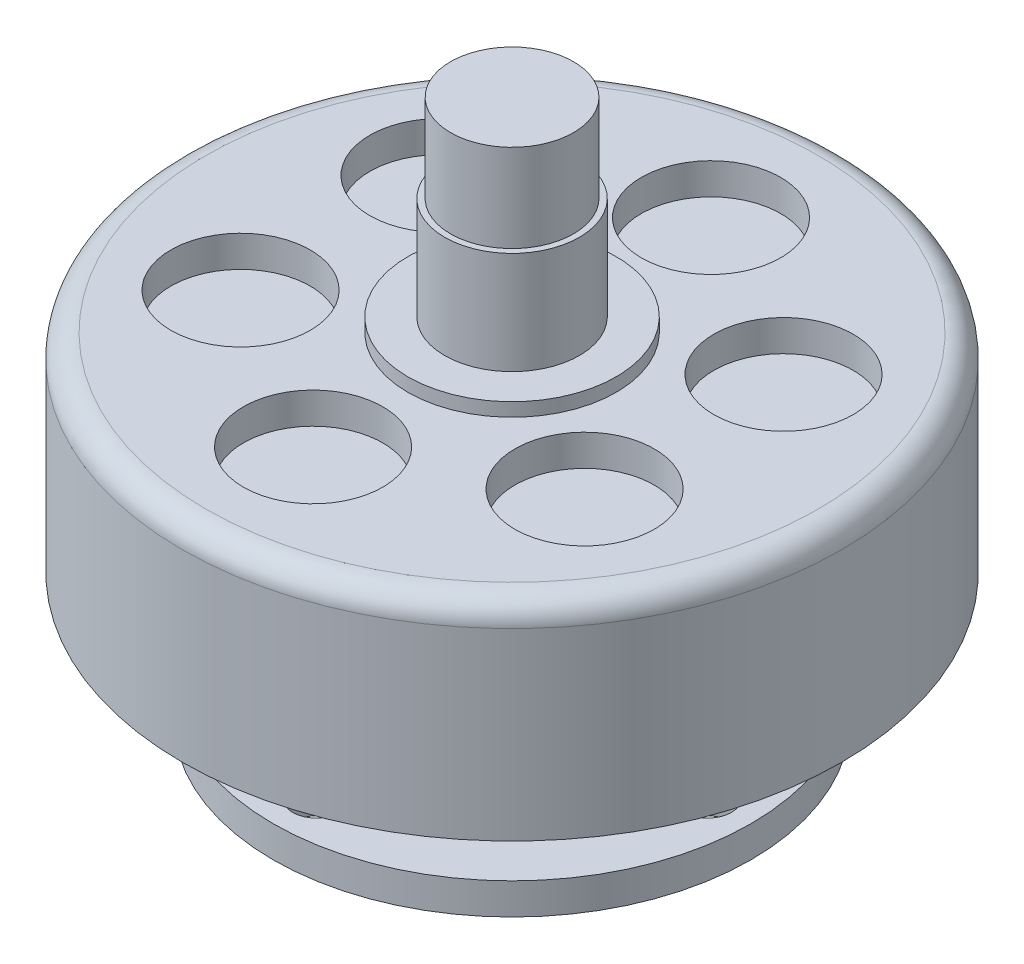
ISO-10303-21;
HEADER;
FILE_DESCRIPTION(('STEP AP214'),'2;1');
FILE_NAME('part.step','',(''),(''),'','','');
FILE_SCHEMA(('AUTOMOTIVE_DESIGN { 1 0 10303 214 1 1 1 1 }'));
ENDSEC;
DATA;
#1=APPLICATION_CONTEXT('core data for automotive mechanical design processes');
#2=APPLICATION_PROTOCOL_DEFINITION('international standard','automotive_design',2000,#1);
#3=PRODUCT_CONTEXT('',#1,'mechanical');
#4=PRODUCT('Part','Part','',(#3));
#5=PRODUCT_RELATED_PRODUCT_CATEGORY('part','',(#4));
#6=PRODUCT_DEFINITION_FORMATION('','',#4);
#7=PRODUCT_DEFINITION_CONTEXT('part definition',#1,'design');
#8=PRODUCT_DEFINITION('design','',#6,#7);
#9=PRODUCT_DEFINITION_SHAPE('','',#8);
#10=(LENGTH_UNIT() NAMED_UNIT(*) SI_UNIT(.MILLI.,.METRE.));
#11=(NAMED_UNIT(*) PLANE_ANGLE_UNIT() SI_UNIT($,.RADIAN.));
#12=(NAMED_UNIT(*) SI_UNIT($,.STERADIAN.) SOLID_ANGLE_UNIT());
#13=UNCERTAINTY_MEASURE_WITH_UNIT(LENGTH_MEASURE(1.E-05),#10,'distance_accuracy_value','');
#14=(GEOMETRIC_REPRESENTATION_CONTEXT(3) GLOBAL_UNCERTAINTY_ASSIGNED_CONTEXT((#13)) GLOBAL_UNIT_ASSIGNED_CONTEXT((#10,
#11,#12)) REPRESENTATION_CONTEXT('',''));
#15=CARTESIAN_POINT('',(0.,0.,0.));
#16=DIRECTION('',(0.,0.,1.));
#17=DIRECTION('',(1.,0.,0.));
#18=AXIS2_PLACEMENT_3D('',#15,#16,#17);
#19=CARTESIAN_POINT('',(0.,-9.5,0.));
#20=DIRECTION('',(0.,-1.,0.));
#21=DIRECTION('',(0.,0.,-1.));
#22=AXIS2_PLACEMENT_3D('',#19,#20,#21);
#23=PLANE('',#22);
#24=CARTESIAN_POINT('',(0.,-9.5,0.));
#25=DIRECTION('',(0.,-1.,0.));
#26=DIRECTION('',(0.,0.,-1.));
#27=AXIS2_PLACEMENT_3D('',#24,#25,#26);
#28=CIRCLE('',#27,3.);
#29=CARTESIAN_POINT('',(-1.75,-9.5,2.43669858620224));
#30=VERTEX_POINT('',#29);
#31=CARTESIAN_POINT('',(1.75,-9.5,2.43669858620224));
#32=VERTEX_POINT('',#31);
#33=EDGE_CURVE('E62',#30,#32,#28,.T.);
#34=ORIENTED_EDGE('',*,*,#33,.T.);
#35=DIRECTION('',(0.,0.,1.));
#36=VECTOR('',#35,1.);
#37=CARTESIAN_POINT('',(1.75,-9.5,3.45));
#38=LINE('',#37,#36);
#39=CARTESIAN_POINT('',(1.75,-9.5,0.968245836551854));
#40=VERTEX_POINT('',#39);
#41=EDGE_CURVE('E120',#40,#32,#38,.T.);
#42=ORIENTED_EDGE('',*,*,#41,.F.);
#43=CARTESIAN_POINT('',(0.,-9.5,0.));
#44=DIRECTION('',(0.,-1.,0.));
#45=DIRECTION('',(0.,0.,-1.));
#46=AXIS2_PLACEMENT_3D('',#43,#44,#45);
#47=CIRCLE('',#46,2.);
#48=CARTESIAN_POINT('',(-1.75,-9.5,0.968245836551854));
#49=VERTEX_POINT('',#48);
#50=EDGE_CURVE('E130',#49,#40,#47,.T.);
#51=ORIENTED_EDGE('',*,*,#50,.F.);
#52=DIRECTION('',(0.,0.,-1.));
#53=VECTOR('',#52,1.);
#54=CARTESIAN_POINT('',(-1.75,-9.5,0.0104918949249585));
#55=LINE('',#54,#53);
#56=EDGE_CURVE('E58',#30,#49,#55,.T.);
#57=ORIENTED_EDGE('',*,*,#56,.F.);
#58=EDGE_LOOP('',(#34,#42,#51,#57));
#59=FACE_BOUND('',#58,.T.);
#60=ADVANCED_FACE('F41',(#59),#23,.T.);
#61=CARTESIAN_POINT('',(0.,-11.,0.));
#62=DIRECTION('',(0.,1.,0.));
#63=DIRECTION('',(0.,0.,1.));
#64=AXIS2_PLACEMENT_3D('',#61,#62,#63);
#65=CYLINDRICAL_SURFACE('',#64,2.);
#66=CARTESIAN_POINT('',(0.,-11.,0.));
#67=DIRECTION('',(0.,-1.,0.));
#68=DIRECTION('',(0.,0.,-1.));
#69=AXIS2_PLACEMENT_3D('',#66,#67,#68);
#70=CIRCLE('',#69,2.);
#71=CARTESIAN_POINT('',(0.,-11.,-2.));
#72=VERTEX_POINT('',#71);
#73=EDGE_CURVE('E133',#72,#72,#70,.T.);
#74=ORIENTED_EDGE('',*,*,#73,.F.);
#75=EDGE_LOOP('',(#74));
#76=FACE_BOUND('',#75,.T.);
#77=DIRECTION('',(0.,1.,0.));
#78=VECTOR('',#77,1.);
#79=CARTESIAN_POINT('',(1.75,-11.,0.968245836551854));
#80=LINE('',#79,#78);
#81=CARTESIAN_POINT('',(1.75,-9.7,0.968245836551854));
#82=VERTEX_POINT('',#81);
#83=EDGE_CURVE('E11',#82,#40,#80,.T.);
#84=ORIENTED_EDGE('',*,*,#83,.F.);
#85=CARTESIAN_POINT('',(0.,-9.7,0.));
#86=DIRECTION('',(0.,1.,0.));
#87=DIRECTION('',(0.,0.,1.));
#88=AXIS2_PLACEMENT_3D('',#85,#86,#87);
#89=CIRCLE('',#88,2.);
#90=CARTESIAN_POINT('',(-1.75,-9.7,0.968245836551854));
#91=VERTEX_POINT('',#90);
#92=EDGE_CURVE('E96',#91,#82,#89,.T.);
#93=ORIENTED_EDGE('',*,*,#92,.F.);
#94=DIRECTION('',(0.,1.,0.));
#95=VECTOR('',#94,1.);
#96=CARTESIAN_POINT('',(-1.75,-11.,0.968245836551854));
#97=LINE('',#96,#95);
#98=EDGE_CURVE('E50',#49,#91,#97,.F.);
#99=ORIENTED_EDGE('',*,*,#98,.F.);
#100=ORIENTED_EDGE('',*,*,#50,.T.);
#101=EDGE_LOOP('',(#84,#93,#99,#100));
#102=FACE_BOUND('',#101,.T.);
#103=ADVANCED_FACE('F283',(#76,#102),#65,.T.);
#104=CARTESIAN_POINT('',(0.,13.25,0.));
#105=DIRECTION('',(0.,-1.,0.));
#106=DIRECTION('',(0.,0.,-1.));
#107=AXIS2_PLACEMENT_3D('',#104,#105,#106);
#108=CYLINDRICAL_SURFACE('',#107,21.05);
#109=CARTESIAN_POINT('',(0.,11.75,0.));
#110=DIRECTION('',(0.,1.,0.));
#111=DIRECTION('',(0.,0.,1.));
#112=AXIS2_PLACEMENT_3D('',#109,#110,#111);
#113=CIRCLE('',#112,21.05);
#114=CARTESIAN_POINT('',(0.,11.75,21.05));
#115=VERTEX_POINT('',#114);
#116=EDGE_CURVE('E214',#115,#115,#113,.F.);
#117=ORIENTED_EDGE('',*,*,#116,.T.);
#118=EDGE_LOOP('',(#117));
#119=FACE_BOUND('',#118,.T.);
#120=CARTESIAN_POINT('',(0.,0.,0.));
#121=DIRECTION('',(0.,1.,0.));
#122=DIRECTION('',(0.,0.,1.));
#123=AXIS2_PLACEMENT_3D('',#120,#121,#122);
#124=CIRCLE('',#123,21.05);
#125=CARTESIAN_POINT('',(0.,0.,21.05));
#126=VERTEX_POINT('',#125);
#127=EDGE_CURVE('E206',#126,#126,#124,.T.);
#128=ORIENTED_EDGE('',*,*,#127,.T.);
#129=EDGE_LOOP('',(#128));
#130=FACE_BOUND('',#129,.T.);
#131=ADVANCED_FACE('F253',(#119,#130),#108,.T.);
#132=CARTESIAN_POINT('',(0.,13.25,0.));
#133=DIRECTION('',(0.,1.,0.));
#134=DIRECTION('',(0.,0.,1.));
#135=AXIS2_PLACEMENT_3D('',#132,#133,#134);
#136=PLANE('',#135);
#137=CARTESIAN_POINT('',(0.,13.25,0.));
#138=DIRECTION('',(0.,1.,0.));
#139=DIRECTION('',(0.,0.,1.));
#140=AXIS2_PLACEMENT_3D('',#137,#138,#139);
#141=CIRCLE('',#140,6.65);
#142=CARTESIAN_POINT('',(0.,13.25,6.65));
#143=VERTEX_POINT('',#142);
#144=EDGE_CURVE('E234',#143,#143,#141,.T.);
#145=ORIENTED_EDGE('',*,*,#144,.F.);
#146=EDGE_LOOP('',(#145));
#147=FACE_BOUND('',#146,.T.);
#148=CARTESIAN_POINT('',(10.9964027158197,13.25,-6.33612373210293));
#149=DIRECTION('',(0.,1.,0.));
#150=DIRECTION('',(0.,0.,1.));
#151=AXIS2_PLACEMENT_3D('',#148,#149,#150);
#152=CIRCLE('',#151,4.45);
#153=CARTESIAN_POINT('',(10.9964027158197,13.25,-1.88612373210293));
#154=VERTEX_POINT('',#153);
#155=EDGE_CURVE('E177',#154,#154,#152,.T.);
#156=ORIENTED_EDGE('',*,*,#155,.F.);
#157=EDGE_LOOP('',(#156));
#158=FACE_BOUND('',#157,.T.);
#159=CARTESIAN_POINT('',(10.9854454714327,13.25,6.3551022360922));
#160=DIRECTION('',(0.,1.,0.));
#161=DIRECTION('',(0.,0.,1.));
#162=AXIS2_PLACEMENT_3D('',#159,#160,#161);
#163=CIRCLE('',#162,4.45);
#164=CARTESIAN_POINT('',(10.9854454714327,13.25,10.8051022360922));
#165=VERTEX_POINT('',#164);
#166=EDGE_CURVE('E183',#165,#165,#163,.T.);
#167=ORIENTED_EDGE('',*,*,#166,.F.);
#168=EDGE_LOOP('',(#167));
#169=FACE_BOUND('',#168,.T.);
#170=CARTESIAN_POINT('',(-0.0109572443865988,13.25,12.6912259681951));
#171=DIRECTION('',(0.,1.,0.));
#172=DIRECTION('',(0.,0.,1.));
#173=AXIS2_PLACEMENT_3D('',#170,#171,#172);
#174=CIRCLE('',#173,4.45);
#175=CARTESIAN_POINT('',(-0.0109572443865988,13.25,17.1412259681951));
#176=VERTEX_POINT('',#175);
#177=EDGE_CURVE('E189',#176,#176,#174,.T.);
#178=ORIENTED_EDGE('',*,*,#177,.F.);
#179=EDGE_LOOP('',(#178));
#180=FACE_BOUND('',#179,.T.);
#181=CARTESIAN_POINT('',(-10.9964027158188,13.25,6.33612373210293));
#182=DIRECTION('',(0.,1.,0.));
#183=DIRECTION('',(0.,0.,1.));
#184=AXIS2_PLACEMENT_3D('',#181,#182,#183);
#185=CIRCLE('',#184,4.45);
#186=CARTESIAN_POINT('',(-10.9964027158188,13.25,10.7861237321029));
#187=VERTEX_POINT('',#186);
#188=EDGE_CURVE('E195',#187,#187,#185,.T.);
#189=ORIENTED_EDGE('',*,*,#188,.F.);
#190=EDGE_LOOP('',(#189));
#191=FACE_BOUND('',#190,.T.);
#192=CARTESIAN_POINT('',(-10.9854454714318,13.25,-6.35510223609219));
#193=DIRECTION('',(0.,1.,0.));
#194=DIRECTION('',(0.,0.,1.));
#195=AXIS2_PLACEMENT_3D('',#192,#193,#194);
#196=CIRCLE('',#195,4.45);
#197=CARTESIAN_POINT('',(-10.9854454714318,13.25,-1.90510223609219));
#198=VERTEX_POINT('',#197);
#199=EDGE_CURVE('E172',#198,#198,#196,.T.);
#200=ORIENTED_EDGE('',*,*,#199,.F.);
#201=EDGE_LOOP('',(#200));
#202=FACE_BOUND('',#201,.T.);
#203=CARTESIAN_POINT('',(0.0109572443874472,13.25,-12.6912259681951));
#204=DIRECTION('',(0.,1.,0.));
#205=DIRECTION('',(0.,0.,1.));
#206=AXIS2_PLACEMENT_3D('',#203,#204,#205);
#207=CIRCLE('',#206,4.45);
#208=CARTESIAN_POINT('',(0.0109572443874472,13.25,-8.24122596819513));
#209=VERTEX_POINT('',#208);
#210=EDGE_CURVE('E176',#209,#209,#207,.T.);
#211=ORIENTED_EDGE('',*,*,#210,.F.);
#212=EDGE_LOOP('',(#211));
#213=FACE_BOUND('',#212,.T.);
#214=CARTESIAN_POINT('',(0.,13.25,0.));
#215=DIRECTION('',(0.,1.,0.));
#216=DIRECTION('',(0.,0.,1.));
#217=AXIS2_PLACEMENT_3D('',#214,#215,#216);
#218=CIRCLE('',#217,19.55);
#219=CARTESIAN_POINT('',(0.,13.25,19.55));
#220=VERTEX_POINT('',#219);
#221=EDGE_CURVE('E211',#220,#220,#218,.T.);
#222=ORIENTED_EDGE('',*,*,#221,.T.);
#223=EDGE_LOOP('',(#222));
#224=FACE_BOUND('',#223,.T.);
#225=ADVANCED_FACE('F249',(#147,#158,#169,#180,#191,#202,#213,#224),#136,.T.);
#226=CARTESIAN_POINT('',(0.,0.,0.));
#227=DIRECTION('',(0.,1.,0.));
#228=DIRECTION('',(0.,0.,1.));
#229=AXIS2_PLACEMENT_3D('',#226,#227,#228);
#230=PLANE('',#229);
#231=CARTESIAN_POINT('',(0.,0.,0.));
#232=DIRECTION('',(0.,1.,0.));
#233=DIRECTION('',(0.,0.,1.));
#234=AXIS2_PLACEMENT_3D('',#231,#232,#233);
#235=CIRCLE('',#234,5.90865219308832);
#236=CARTESIAN_POINT('',(0.,0.,5.90865219308832));
#237=VERTEX_POINT('',#236);
#238=EDGE_CURVE('E217',#237,#237,#235,.F.);
#239=ORIENTED_EDGE('',*,*,#238,.F.);
#240=EDGE_LOOP('',(#239));
#241=FACE_BOUND('',#240,.T.);
#242=ORIENTED_EDGE('',*,*,#127,.F.);
#243=EDGE_LOOP('',(#242));
#244=FACE_BOUND('',#243,.T.);
#245=ADVANCED_FACE('F252',(#241,#244),#230,.F.);
#246=CARTESIAN_POINT('',(0.,11.75,0.));
#247=DIRECTION('',(0.,1.,0.));
#248=DIRECTION('',(0.,0.,1.));
#249=AXIS2_PLACEMENT_3D('',#246,#247,#248);
#250=TOROIDAL_SURFACE('',#249,19.55,1.5);
#251=ORIENTED_EDGE('',*,*,#116,.F.);
#252=EDGE_LOOP('',(#251));
#253=FACE_BOUND('',#252,.T.);
#254=ORIENTED_EDGE('',*,*,#221,.F.);
#255=EDGE_LOOP('',(#254));
#256=FACE_BOUND('',#255,.T.);
#257=ADVANCED_FACE('F43',(#253,#256),#250,.T.);
#258=CARTESIAN_POINT('',(0.0109572443874472,11.25,-12.6912259681951));
#259=DIRECTION('',(0.,1.,0.));
#260=DIRECTION('',(0.,0.,1.));
#261=AXIS2_PLACEMENT_3D('',#258,#259,#260);
#262=CYLINDRICAL_SURFACE('',#261,4.45);
#263=CARTESIAN_POINT('',(0.0109572443874472,11.25,-12.6912259681951));
#264=DIRECTION('',(0.,1.,0.));
#265=DIRECTION('',(0.,0.,1.));
#266=AXIS2_PLACEMENT_3D('',#263,#264,#265);
#267=CIRCLE('',#266,4.45);
#268=CARTESIAN_POINT('',(0.0109572443874472,11.25,-8.24122596819513));
#269=VERTEX_POINT('',#268);
#270=EDGE_CURVE('E203',#269,#269,#267,.T.);
#271=ORIENTED_EDGE('',*,*,#270,.F.);
#272=EDGE_LOOP('',(#271));
#273=FACE_BOUND('',#272,.T.);
#274=ORIENTED_EDGE('',*,*,#210,.T.);
#275=EDGE_LOOP('',(#274));
#276=FACE_BOUND('',#275,.T.);
#277=ADVANCED_FACE('F270',(#273,#276),#262,.F.);
#278=CARTESIAN_POINT('',(0.0109572443874472,11.25,-12.6912259681951));
#279=DIRECTION('',(0.,1.,0.));
#280=DIRECTION('',(0.,0.,1.));
#281=AXIS2_PLACEMENT_3D('',#278,#279,#280);
#282=PLANE('',#281);
#283=ORIENTED_EDGE('',*,*,#270,.T.);
#284=EDGE_LOOP('',(#283));
#285=FACE_BOUND('',#284,.T.);
#286=ADVANCED_FACE('F276',(#285),#282,.T.);
#287=CARTESIAN_POINT('',(-10.9854454714318,11.25,-6.35510223609219));
#288=DIRECTION('',(0.,1.,0.));
#289=DIRECTION('',(0.,0.,1.));
#290=AXIS2_PLACEMENT_3D('',#287,#288,#289);
#291=CYLINDRICAL_SURFACE('',#290,4.45);
#292=CARTESIAN_POINT('',(-10.9854454714318,11.25,-6.35510223609219));
#293=DIRECTION('',(0.,1.,0.));
#294=DIRECTION('',(0.,0.,1.));
#295=AXIS2_PLACEMENT_3D('',#292,#293,#294);
#296=CIRCLE('',#295,4.45);
#297=CARTESIAN_POINT('',(-10.9854454714318,11.25,-1.90510223609219));
#298=VERTEX_POINT('',#297);
#299=EDGE_CURVE('E198',#298,#298,#296,.T.);
#300=ORIENTED_EDGE('',*,*,#299,.F.);
#301=EDGE_LOOP('',(#300));
#302=FACE_BOUND('',#301,.T.);
#303=ORIENTED_EDGE('',*,*,#199,.T.);
#304=EDGE_LOOP('',(#303));
#305=FACE_BOUND('',#304,.T.);
#306=ADVANCED_FACE('F376',(#302,#305),#291,.F.);
#307=CARTESIAN_POINT('',(-10.9854454714318,11.25,-6.35510223609219));
#308=DIRECTION('',(0.,1.,0.));
#309=DIRECTION('',(0.,0.,1.));
#310=AXIS2_PLACEMENT_3D('',#307,#308,#309);
#311=PLANE('',#310);
#312=ORIENTED_EDGE('',*,*,#299,.T.);
#313=EDGE_LOOP('',(#312));
#314=FACE_BOUND('',#313,.T.);
#315=ADVANCED_FACE('F372',(#314),#311,.T.);
#316=CARTESIAN_POINT('',(-10.9964027158188,11.25,6.33612373210293));
#317=DIRECTION('',(0.,1.,0.));
#318=DIRECTION('',(0.,0.,1.));
#319=AXIS2_PLACEMENT_3D('',#316,#317,#318);
#320=CYLINDRICAL_SURFACE('',#319,4.45);
#321=CARTESIAN_POINT('',(-10.9964027158188,11.25,6.33612373210293));
#322=DIRECTION('',(0.,1.,0.));
#323=DIRECTION('',(0.,0.,1.));
#324=AXIS2_PLACEMENT_3D('',#321,#322,#323);
#325=CIRCLE('',#324,4.45);
#326=CARTESIAN_POINT('',(-10.9964027158188,11.25,10.7861237321029));
#327=VERTEX_POINT('',#326);
#328=EDGE_CURVE('E192',#327,#327,#325,.T.);
#329=ORIENTED_EDGE('',*,*,#328,.F.);
#330=EDGE_LOOP('',(#329));
#331=FACE_BOUND('',#330,.T.);
#332=ORIENTED_EDGE('',*,*,#188,.T.);
#333=EDGE_LOOP('',(#332));
#334=FACE_BOUND('',#333,.T.);
#335=ADVANCED_FACE('F368',(#331,#334),#320,.F.);
#336=CARTESIAN_POINT('',(-10.9964027158188,11.25,6.33612373210293));
#337=DIRECTION('',(0.,1.,0.));
#338=DIRECTION('',(0.,0.,1.));
#339=AXIS2_PLACEMENT_3D('',#336,#337,#338);
#340=PLANE('',#339);
#341=ORIENTED_EDGE('',*,*,#328,.T.);
#342=EDGE_LOOP('',(#341));
#343=FACE_BOUND('',#342,.T.);
#344=ADVANCED_FACE('F364',(#343),#340,.T.);
#345=CARTESIAN_POINT('',(-0.0109572443865988,11.25,12.6912259681951));
#346=DIRECTION('',(0.,1.,0.));
#347=DIRECTION('',(0.,0.,1.));
#348=AXIS2_PLACEMENT_3D('',#345,#346,#347);
#349=CYLINDRICAL_SURFACE('',#348,4.45);
#350=CARTESIAN_POINT('',(-0.0109572443865988,11.25,12.6912259681951));
#351=DIRECTION('',(0.,1.,0.));
#352=DIRECTION('',(0.,0.,1.));
#353=AXIS2_PLACEMENT_3D('',#350,#351,#352);
#354=CIRCLE('',#353,4.45);
#355=CARTESIAN_POINT('',(-0.0109572443865988,11.25,17.1412259681951));
#356=VERTEX_POINT('',#355);
#357=EDGE_CURVE('E186',#356,#356,#354,.T.);
#358=ORIENTED_EDGE('',*,*,#357,.F.);
#359=EDGE_LOOP('',(#358));
#360=FACE_BOUND('',#359,.T.);
#361=ORIENTED_EDGE('',*,*,#177,.T.);
#362=EDGE_LOOP('',(#361));
#363=FACE_BOUND('',#362,.T.);
#364=ADVANCED_FACE('F360',(#360,#363),#349,.F.);
#365=CARTESIAN_POINT('',(-0.0109572443865988,11.25,12.6912259681951));
#366=DIRECTION('',(0.,1.,0.));
#367=DIRECTION('',(0.,0.,1.));
#368=AXIS2_PLACEMENT_3D('',#365,#366,#367);
#369=PLANE('',#368);
#370=ORIENTED_EDGE('',*,*,#357,.T.);
#371=EDGE_LOOP('',(#370));
#372=FACE_BOUND('',#371,.T.);
#373=ADVANCED_FACE('F356',(#372),#369,.T.);
#374=CARTESIAN_POINT('',(10.9854454714327,11.25,6.3551022360922));
#375=DIRECTION('',(0.,1.,0.));
#376=DIRECTION('',(0.,0.,1.));
#377=AXIS2_PLACEMENT_3D('',#374,#375,#376);
#378=CYLINDRICAL_SURFACE('',#377,4.45);
#379=CARTESIAN_POINT('',(10.9854454714327,11.25,6.3551022360922));
#380=DIRECTION('',(0.,1.,0.));
#381=DIRECTION('',(0.,0.,1.));
#382=AXIS2_PLACEMENT_3D('',#379,#380,#381);
#383=CIRCLE('',#382,4.45);
#384=CARTESIAN_POINT('',(10.9854454714327,11.25,10.8051022360922));
#385=VERTEX_POINT('',#384);
#386=EDGE_CURVE('E180',#385,#385,#383,.T.);
#387=ORIENTED_EDGE('',*,*,#386,.F.);
#388=EDGE_LOOP('',(#387));
#389=FACE_BOUND('',#388,.T.);
#390=ORIENTED_EDGE('',*,*,#166,.T.);
#391=EDGE_LOOP('',(#390));
#392=FACE_BOUND('',#391,.T.);
#393=ADVANCED_FACE('F352',(#389,#392),#378,.F.);
#394=CARTESIAN_POINT('',(10.9854454714327,11.25,6.3551022360922));
#395=DIRECTION('',(0.,1.,0.));
#396=DIRECTION('',(0.,0.,1.));
#397=AXIS2_PLACEMENT_3D('',#394,#395,#396);
#398=PLANE('',#397);
#399=ORIENTED_EDGE('',*,*,#386,.T.);
#400=EDGE_LOOP('',(#399));
#401=FACE_BOUND('',#400,.T.);
#402=ADVANCED_FACE('F348',(#401),#398,.T.);
#403=CARTESIAN_POINT('',(10.9964027158197,11.25,-6.33612373210293));
#404=DIRECTION('',(0.,1.,0.));
#405=DIRECTION('',(0.,0.,1.));
#406=AXIS2_PLACEMENT_3D('',#403,#404,#405);
#407=CYLINDRICAL_SURFACE('',#406,4.45);
#408=CARTESIAN_POINT('',(10.9964027158197,11.25,-6.33612373210293));
#409=DIRECTION('',(0.,1.,0.));
#410=DIRECTION('',(0.,0.,1.));
#411=AXIS2_PLACEMENT_3D('',#408,#409,#410);
#412=CIRCLE('',#411,4.45);
#413=CARTESIAN_POINT('',(10.9964027158197,11.25,-1.88612373210293));
#414=VERTEX_POINT('',#413);
#415=EDGE_CURVE('E173',#414,#414,#412,.T.);
#416=ORIENTED_EDGE('',*,*,#415,.F.);
#417=EDGE_LOOP('',(#416));
#418=FACE_BOUND('',#417,.T.);
#419=ORIENTED_EDGE('',*,*,#155,.T.);
#420=EDGE_LOOP('',(#419));
#421=FACE_BOUND('',#420,.T.);
#422=ADVANCED_FACE('F344',(#418,#421),#407,.F.);
#423=CARTESIAN_POINT('',(10.9964027158197,11.25,-6.33612373210293));
#424=DIRECTION('',(0.,1.,0.));
#425=DIRECTION('',(0.,0.,1.));
#426=AXIS2_PLACEMENT_3D('',#423,#424,#425);
#427=PLANE('',#426);
#428=ORIENTED_EDGE('',*,*,#415,.T.);
#429=EDGE_LOOP('',(#428));
#430=FACE_BOUND('',#429,.T.);
#431=ADVANCED_FACE('F332',(#430),#427,.T.);
#432=CARTESIAN_POINT('',(0.,-6.3,0.));
#433=DIRECTION('',(0.,1.,0.));
#434=DIRECTION('',(0.,0.,1.));
#435=AXIS2_PLACEMENT_3D('',#432,#433,#434);
#436=CYLINDRICAL_SURFACE('',#435,5.90865219308832);
#437=CARTESIAN_POINT('',(0.,-6.3,0.));
#438=DIRECTION('',(0.,-1.,0.));
#439=DIRECTION('',(0.,0.,-1.));
#440=AXIS2_PLACEMENT_3D('',#437,#438,#439);
#441=CIRCLE('',#440,5.90865219308832);
#442=CARTESIAN_POINT('',(0.,-6.3,-5.90865219308832));
#443=VERTEX_POINT('',#442);
#444=EDGE_CURVE('E164',#443,#443,#441,.T.);
#445=ORIENTED_EDGE('',*,*,#444,.F.);
#446=EDGE_LOOP('',(#445));
#447=FACE_BOUND('',#446,.T.);
#448=ORIENTED_EDGE('',*,*,#238,.T.);
#449=EDGE_LOOP('',(#448));
#450=FACE_BOUND('',#449,.T.);
#451=ADVANCED_FACE('F322',(#447,#450),#436,.T.);
#452=CARTESIAN_POINT('',(0.,-8.3,0.));
#453=DIRECTION('',(0.,-1.,0.));
#454=DIRECTION('',(0.,0.,-1.));
#455=AXIS2_PLACEMENT_3D('',#452,#453,#454);
#456=PLANE('',#455);
#457=CARTESIAN_POINT('',(0.,-8.3,0.));
#458=DIRECTION('',(0.,-1.,0.));
#459=DIRECTION('',(0.,0.,-1.));
#460=AXIS2_PLACEMENT_3D('',#457,#458,#459);
#461=CIRCLE('',#460,3.);
#462=CARTESIAN_POINT('',(0.,-8.3,-3.));
#463=VERTEX_POINT('',#462);
#464=EDGE_CURVE('E108',#463,#463,#461,.T.);
#465=ORIENTED_EDGE('',*,*,#464,.F.);
#466=EDGE_LOOP('',(#465));
#467=FACE_BOUND('',#466,.T.);
#468=CARTESIAN_POINT('',(3.53740559381116E-13,-8.3,-12.5));
#469=DIRECTION('',(0.,-1.,0.));
#470=DIRECTION('',(0.,0.,-1.));
#471=AXIS2_PLACEMENT_3D('',#468,#469,#470);
#472=CIRCLE('',#471,1.5);
#473=CARTESIAN_POINT('',(3.53740559381116E-13,-8.3,-14.));
#474=VERTEX_POINT('',#473);
#475=EDGE_CURVE('E143',#474,#474,#472,.T.);
#476=ORIENTED_EDGE('',*,*,#475,.F.);
#477=EDGE_LOOP('',(#476));
#478=FACE_BOUND('',#477,.T.);
#479=CARTESIAN_POINT('',(-3.53740559381116E-13,-8.3,12.5));
#480=DIRECTION('',(0.,-1.,0.));
#481=DIRECTION('',(0.,0.,-1.));
#482=AXIS2_PLACEMENT_3D('',#479,#480,#481);
#483=CIRCLE('',#482,1.5);
#484=CARTESIAN_POINT('',(-3.53740559381116E-13,-8.3,11.));
#485=VERTEX_POINT('',#484);
#486=EDGE_CURVE('E155',#485,#485,#483,.T.);
#487=ORIENTED_EDGE('',*,*,#486,.F.);
#488=EDGE_LOOP('',(#487));
#489=FACE_BOUND('',#488,.T.);
#490=CARTESIAN_POINT('',(0.,-8.3,0.));
#491=DIRECTION('',(0.,-1.,0.));
#492=DIRECTION('',(0.,0.,-1.));
#493=AXIS2_PLACEMENT_3D('',#490,#491,#492);
#494=CIRCLE('',#493,15.25);
#495=CARTESIAN_POINT('',(0.,-8.3,-15.25));
#496=VERTEX_POINT('',#495);
#497=EDGE_CURVE('E161',#496,#496,#494,.T.);
#498=ORIENTED_EDGE('',*,*,#497,.T.);
#499=EDGE_LOOP('',(#498));
#500=FACE_BOUND('',#499,.T.);
#501=CARTESIAN_POINT('',(12.5,-8.3,3.54505963630583E-13));
#502=DIRECTION('',(0.,-1.,0.));
#503=DIRECTION('',(0.,0.,-1.));
#504=AXIS2_PLACEMENT_3D('',#501,#502,#503);
#505=CIRCLE('',#504,1.5);
#506=CARTESIAN_POINT('',(12.5,-8.3,-1.49999999999965));
#507=VERTEX_POINT('',#506);
#508=EDGE_CURVE('E149',#507,#507,#505,.T.);
#509=ORIENTED_EDGE('',*,*,#508,.F.);
#510=EDGE_LOOP('',(#509));
#511=FACE_BOUND('',#510,.T.);
#512=CARTESIAN_POINT('',(-12.5,-8.3,-3.56036772129517E-13));
#513=DIRECTION('',(0.,-1.,0.));
#514=DIRECTION('',(0.,0.,-1.));
#515=AXIS2_PLACEMENT_3D('',#512,#513,#514);
#516=CIRCLE('',#515,1.5);
#517=CARTESIAN_POINT('',(-12.5,-8.3,-1.50000000000036));
#518=VERTEX_POINT('',#517);
#519=EDGE_CURVE('E137',#518,#518,#516,.T.);
#520=ORIENTED_EDGE('',*,*,#519,.F.);
#521=EDGE_LOOP('',(#520));
#522=FACE_BOUND('',#521,.T.);
#523=ADVANCED_FACE('F318',(#467,#478,#489,#500,#511,#522),#456,.T.);
#524=CARTESIAN_POINT('',(0.,-6.3,0.));
#525=DIRECTION('',(0.,-1.,0.));
#526=DIRECTION('',(0.,0.,-1.));
#527=AXIS2_PLACEMENT_3D('',#524,#525,#526);
#528=PLANE('',#527);
#529=ORIENTED_EDGE('',*,*,#444,.T.);
#530=EDGE_LOOP('',(#529));
#531=FACE_BOUND('',#530,.T.);
#532=CARTESIAN_POINT('',(0.,-6.3,0.));
#533=DIRECTION('',(0.,-1.,0.));
#534=DIRECTION('',(0.,0.,-1.));
#535=AXIS2_PLACEMENT_3D('',#532,#533,#534);
#536=CIRCLE('',#535,15.25);
#537=CARTESIAN_POINT('',(0.,-6.3,-15.25));
#538=VERTEX_POINT('',#537);
#539=EDGE_CURVE('E158',#538,#538,#536,.T.);
#540=ORIENTED_EDGE('',*,*,#539,.F.);
#541=EDGE_LOOP('',(#540));
#542=FACE_BOUND('',#541,.T.);
#543=CARTESIAN_POINT('',(-3.53740559381116E-13,-6.3,12.5));
#544=DIRECTION('',(0.,-1.,0.));
#545=DIRECTION('',(0.,0.,-1.));
#546=AXIS2_PLACEMENT_3D('',#543,#544,#545);
#547=CIRCLE('',#546,1.5);
#548=CARTESIAN_POINT('',(-3.53740559381116E-13,-6.3,11.));
#549=VERTEX_POINT('',#548);
#550=EDGE_CURVE('E152',#549,#549,#547,.T.);
#551=ORIENTED_EDGE('',*,*,#550,.T.);
#552=EDGE_LOOP('',(#551));
#553=FACE_BOUND('',#552,.T.);
#554=CARTESIAN_POINT('',(12.5,-6.3,3.54505963630583E-13));
#555=DIRECTION('',(0.,-1.,0.));
#556=DIRECTION('',(0.,0.,-1.));
#557=AXIS2_PLACEMENT_3D('',#554,#555,#556);
#558=CIRCLE('',#557,1.5);
#559=CARTESIAN_POINT('',(12.5,-6.3,-1.49999999999965));
#560=VERTEX_POINT('',#559);
#561=EDGE_CURVE('E146',#560,#560,#558,.T.);
#562=ORIENTED_EDGE('',*,*,#561,.T.);
#563=EDGE_LOOP('',(#562));
#564=FACE_BOUND('',#563,.T.);
#565=CARTESIAN_POINT('',(3.53740559381116E-13,-6.3,-12.5));
#566=DIRECTION('',(0.,-1.,0.));
#567=DIRECTION('',(0.,0.,-1.));
#568=AXIS2_PLACEMENT_3D('',#565,#566,#567);
#569=CIRCLE('',#568,1.5);
#570=CARTESIAN_POINT('',(3.53740559381116E-13,-6.3,-14.));
#571=VERTEX_POINT('',#570);
#572=EDGE_CURVE('E140',#571,#571,#569,.T.);
#573=ORIENTED_EDGE('',*,*,#572,.T.);
#574=EDGE_LOOP('',(#573));
#575=FACE_BOUND('',#574,.T.);
#576=CARTESIAN_POINT('',(-12.5,-6.3,-3.56036772129517E-13));
#577=DIRECTION('',(0.,-1.,0.));
#578=DIRECTION('',(0.,0.,-1.));
#579=AXIS2_PLACEMENT_3D('',#576,#577,#578);
#580=CIRCLE('',#579,1.5);
#581=CARTESIAN_POINT('',(-12.5,-6.3,-1.50000000000036));
#582=VERTEX_POINT('',#581);
#583=EDGE_CURVE('E136',#582,#582,#580,.T.);
#584=ORIENTED_EDGE('',*,*,#583,.T.);
#585=EDGE_LOOP('',(#584));
#586=FACE_BOUND('',#585,.T.);
#587=ADVANCED_FACE('F321',(#531,#542,#553,#564,#575,#586),#528,.F.);
#588=CARTESIAN_POINT('',(0.,-8.3,0.));
#589=DIRECTION('',(0.,1.,0.));
#590=DIRECTION('',(0.,0.,1.));
#591=AXIS2_PLACEMENT_3D('',#588,#589,#590);
#592=CYLINDRICAL_SURFACE('',#591,15.25);
#593=ORIENTED_EDGE('',*,*,#497,.F.);
#594=EDGE_LOOP('',(#593));
#595=FACE_BOUND('',#594,.T.);
#596=ORIENTED_EDGE('',*,*,#539,.T.);
#597=EDGE_LOOP('',(#596));
#598=FACE_BOUND('',#597,.T.);
#599=ADVANCED_FACE('F316',(#595,#598),#592,.T.);
#600=CARTESIAN_POINT('',(-3.53740559381116E-13,-8.3,12.5));
#601=DIRECTION('',(0.,1.,0.));
#602=DIRECTION('',(0.,0.,1.));
#603=AXIS2_PLACEMENT_3D('',#600,#601,#602);
#604=CYLINDRICAL_SURFACE('',#603,1.5);
#605=ORIENTED_EDGE('',*,*,#486,.T.);
#606=EDGE_LOOP('',(#605));
#607=FACE_BOUND('',#606,.T.);
#608=ORIENTED_EDGE('',*,*,#550,.F.);
#609=EDGE_LOOP('',(#608));
#610=FACE_BOUND('',#609,.T.);
#611=ADVANCED_FACE('F312',(#607,#610),#604,.F.);
#612=CARTESIAN_POINT('',(12.5,-8.3,3.54505963630583E-13));
#613=DIRECTION('',(0.,1.,0.));
#614=DIRECTION('',(0.,0.,1.));
#615=AXIS2_PLACEMENT_3D('',#612,#613,#614);
#616=CYLINDRICAL_SURFACE('',#615,1.5);
#617=ORIENTED_EDGE('',*,*,#508,.T.);
#618=EDGE_LOOP('',(#617));
#619=FACE_BOUND('',#618,.T.);
#620=ORIENTED_EDGE('',*,*,#561,.F.);
#621=EDGE_LOOP('',(#620));
#622=FACE_BOUND('',#621,.T.);
#623=ADVANCED_FACE('F308',(#619,#622),#616,.F.);
#624=CARTESIAN_POINT('',(3.53740559381116E-13,-8.3,-12.5));
#625=DIRECTION('',(0.,1.,0.));
#626=DIRECTION('',(0.,0.,1.));
#627=AXIS2_PLACEMENT_3D('',#624,#625,#626);
#628=CYLINDRICAL_SURFACE('',#627,1.5);
#629=ORIENTED_EDGE('',*,*,#475,.T.);
#630=EDGE_LOOP('',(#629));
#631=FACE_BOUND('',#630,.T.);
#632=ORIENTED_EDGE('',*,*,#572,.F.);
#633=EDGE_LOOP('',(#632));
#634=FACE_BOUND('',#633,.T.);
#635=ADVANCED_FACE('F304',(#631,#634),#628,.F.);
#636=CARTESIAN_POINT('',(-12.5,-8.3,-3.56036772129517E-13));
#637=DIRECTION('',(0.,1.,0.));
#638=DIRECTION('',(0.,0.,1.));
#639=AXIS2_PLACEMENT_3D('',#636,#637,#638);
#640=CYLINDRICAL_SURFACE('',#639,1.5);
#641=ORIENTED_EDGE('',*,*,#519,.T.);
#642=EDGE_LOOP('',(#641));
#643=FACE_BOUND('',#642,.T.);
#644=ORIENTED_EDGE('',*,*,#583,.F.);
#645=EDGE_LOOP('',(#644));
#646=FACE_BOUND('',#645,.T.);
#647=ADVANCED_FACE('F297',(#643,#646),#640,.F.);
#648=CARTESIAN_POINT('',(0.,-9.5,0.));
#649=DIRECTION('',(0.,1.,0.));
#650=DIRECTION('',(0.,0.,1.));
#651=AXIS2_PLACEMENT_3D('',#648,#649,#650);
#652=CYLINDRICAL_SURFACE('',#651,3.);
#653=EDGE_CURVE('E127',#32,#30,#28,.T.);
#654=ORIENTED_EDGE('',*,*,#653,.F.);
#655=ORIENTED_EDGE('',*,*,#33,.F.);
#656=EDGE_LOOP('',(#654,#655));
#657=FACE_BOUND('',#656,.T.);
#658=ORIENTED_EDGE('',*,*,#464,.T.);
#659=EDGE_LOOP('',(#658));
#660=FACE_BOUND('',#659,.T.);
#661=ADVANCED_FACE('F293',(#657,#660),#652,.T.);
#662=CARTESIAN_POINT('',(0.,-11.,0.));
#663=DIRECTION('',(0.,-1.,0.));
#664=DIRECTION('',(0.,0.,-1.));
#665=AXIS2_PLACEMENT_3D('',#662,#663,#664);
#666=PLANE('',#665);
#667=ORIENTED_EDGE('',*,*,#73,.T.);
#668=EDGE_LOOP('',(#667));
#669=FACE_BOUND('',#668,.T.);
#670=ADVANCED_FACE('F296',(#669),#666,.T.);
#671=CARTESIAN_POINT('',(1.75,-9.7,3.45));
#672=DIRECTION('',(-1.,0.,0.));
#673=DIRECTION('',(0.,0.,1.));
#674=AXIS2_PLACEMENT_3D('',#671,#672,#673);
#675=PLANE('',#674);
#676=DIRECTION('',(0.,0.,1.));
#677=VECTOR('',#676,1.);
#678=CARTESIAN_POINT('',(1.75,-9.7,3.45));
#679=LINE('',#678,#677);
#680=CARTESIAN_POINT('',(1.75,-9.7,3.45));
#681=VERTEX_POINT('',#680);
#682=EDGE_CURVE('E89',#82,#681,#679,.T.);
#683=ORIENTED_EDGE('',*,*,#682,.F.);
#684=ORIENTED_EDGE('',*,*,#83,.T.);
#685=ORIENTED_EDGE('',*,*,#41,.T.);
#686=CARTESIAN_POINT('',(1.75,-9.5,3.45));
#687=VERTEX_POINT('',#686);
#688=EDGE_CURVE('E105',#32,#687,#38,.T.);
#689=ORIENTED_EDGE('',*,*,#688,.T.);
#690=DIRECTION('',(0.,1.,0.));
#691=VECTOR('',#690,1.);
#692=CARTESIAN_POINT('',(1.75,-9.7,3.45));
#693=LINE('',#692,#691);
#694=EDGE_CURVE('E101',#681,#687,#693,.T.);
#695=ORIENTED_EDGE('',*,*,#694,.F.);
#696=EDGE_LOOP('',(#683,#684,#685,#689,#695));
#697=FACE_BOUND('',#696,.T.);
#698=ADVANCED_FACE('F102',(#697),#675,.F.);
#699=CARTESIAN_POINT('',(-1.75,-9.7,0.0104918949249585));
#700=DIRECTION('',(1.,0.,0.));
#701=DIRECTION('',(0.,0.,-1.));
#702=AXIS2_PLACEMENT_3D('',#699,#700,#701);
#703=PLANE('',#702);
#704=ORIENTED_EDGE('',*,*,#56,.T.);
#705=ORIENTED_EDGE('',*,*,#98,.T.);
#706=DIRECTION('',(0.,0.,-1.));
#707=VECTOR('',#706,1.);
#708=CARTESIAN_POINT('',(-1.75,-9.7,0.0104918949249585));
#709=LINE('',#708,#707);
#710=CARTESIAN_POINT('',(-1.75,-9.7,3.45));
#711=VERTEX_POINT('',#710);
#712=EDGE_CURVE('E114',#711,#91,#709,.T.);
#713=ORIENTED_EDGE('',*,*,#712,.F.);
#714=DIRECTION('',(0.,1.,0.));
#715=VECTOR('',#714,1.);
#716=CARTESIAN_POINT('',(-1.75,-9.7,3.45));
#717=LINE('',#716,#715);
#718=CARTESIAN_POINT('',(-1.75,-9.5,3.45));
#719=VERTEX_POINT('',#718);
#720=EDGE_CURVE('E109',#711,#719,#717,.T.);
#721=ORIENTED_EDGE('',*,*,#720,.T.);
#722=EDGE_CURVE('E98',#719,#30,#55,.T.);
#723=ORIENTED_EDGE('',*,*,#722,.T.);
#724=EDGE_LOOP('',(#704,#705,#713,#721,#723));
#725=FACE_BOUND('',#724,.T.);
#726=ADVANCED_FACE('F558',(#725),#703,.F.);
#727=CARTESIAN_POINT('',(-1.75,-9.7,3.45));
#728=DIRECTION('',(0.,0.,-1.));
#729=DIRECTION('',(-1.,0.,0.));
#730=AXIS2_PLACEMENT_3D('',#727,#728,#729);
#731=PLANE('',#730);
#732=DIRECTION('',(-1.,0.,0.));
#733=VECTOR('',#732,1.);
#734=CARTESIAN_POINT('',(-1.75,-9.5,3.45));
#735=LINE('',#734,#733);
#736=EDGE_CURVE('E122',#687,#719,#735,.T.);
#737=ORIENTED_EDGE('',*,*,#736,.T.);
#738=ORIENTED_EDGE('',*,*,#720,.F.);
#739=DIRECTION('',(-1.,0.,0.));
#740=VECTOR('',#739,1.);
#741=CARTESIAN_POINT('',(-1.75,-9.7,3.45));
#742=LINE('',#741,#740);
#743=EDGE_CURVE('E94',#681,#711,#742,.T.);
#744=ORIENTED_EDGE('',*,*,#743,.F.);
#745=ORIENTED_EDGE('',*,*,#694,.T.);
#746=EDGE_LOOP('',(#737,#738,#744,#745));
#747=FACE_BOUND('',#746,.T.);
#748=ADVANCED_FACE('F111',(#747),#731,.F.);
#749=CARTESIAN_POINT('',(0.,-9.7,0.));
#750=DIRECTION('',(0.,1.,0.));
#751=DIRECTION('',(0.,0.,1.));
#752=AXIS2_PLACEMENT_3D('',#749,#750,#751);
#753=PLANE('',#752);
#754=ORIENTED_EDGE('',*,*,#712,.T.);
#755=ORIENTED_EDGE('',*,*,#92,.T.);
#756=ORIENTED_EDGE('',*,*,#682,.T.);
#757=ORIENTED_EDGE('',*,*,#743,.T.);
#758=EDGE_LOOP('',(#754,#755,#756,#757));
#759=FACE_BOUND('',#758,.T.);
#760=ADVANCED_FACE('F92',(#759),#753,.F.);
#761=CARTESIAN_POINT('',(0.,-9.5,0.));
#762=DIRECTION('',(0.,1.,0.));
#763=DIRECTION('',(0.,0.,1.));
#764=AXIS2_PLACEMENT_3D('',#761,#762,#763);
#765=PLANE('',#764);
#766=ORIENTED_EDGE('',*,*,#653,.T.);
#767=ORIENTED_EDGE('',*,*,#722,.F.);
#768=ORIENTED_EDGE('',*,*,#736,.F.);
#769=ORIENTED_EDGE('',*,*,#688,.F.);
#770=EDGE_LOOP('',(#766,#767,#768,#769));
#771=FACE_BOUND('',#770,.T.);
#772=ADVANCED_FACE('F245',(#771),#765,.T.);
#773=CARTESIAN_POINT('',(0.,14.11,0.));
#774=DIRECTION('',(0.,-1.,0.));
#775=DIRECTION('',(0.,0.,-1.));
#776=AXIS2_PLACEMENT_3D('',#773,#774,#775);
#777=CYLINDRICAL_SURFACE('',#776,6.65);
#778=CARTESIAN_POINT('',(0.,14.11,0.));
#779=DIRECTION('',(0.,1.,0.));
#780=DIRECTION('',(0.,0.,1.));
#781=AXIS2_PLACEMENT_3D('',#778,#779,#780);
#782=CIRCLE('',#781,6.65);
#783=CARTESIAN_POINT('',(0.,14.11,6.65));
#784=VERTEX_POINT('',#783);
#785=EDGE_CURVE('E232',#784,#784,#782,.T.);
#786=ORIENTED_EDGE('',*,*,#785,.F.);
#787=EDGE_LOOP('',(#786));
#788=FACE_BOUND('',#787,.T.);
#789=ORIENTED_EDGE('',*,*,#144,.T.);
#790=EDGE_LOOP('',(#789));
#791=FACE_BOUND('',#790,.T.);
#792=ADVANCED_FACE('F242',(#788,#791),#777,.T.);
#793=CARTESIAN_POINT('',(0.,14.11,0.));
#794=DIRECTION('',(0.,1.,0.));
#795=DIRECTION('',(0.,0.,1.));
#796=AXIS2_PLACEMENT_3D('',#793,#794,#795);
#797=PLANE('',#796);
#798=CARTESIAN_POINT('',(0.,14.11,0.));
#799=DIRECTION('',(0.,1.,0.));
#800=DIRECTION('',(0.,0.,1.));
#801=AXIS2_PLACEMENT_3D('',#798,#799,#800);
#802=CIRCLE('',#801,4.3);
#803=CARTESIAN_POINT('',(0.,14.11,4.3));
#804=VERTEX_POINT('',#803);
#805=EDGE_CURVE('E45',#804,#804,#802,.T.);
#806=ORIENTED_EDGE('',*,*,#805,.F.);
#807=EDGE_LOOP('',(#806));
#808=FACE_BOUND('',#807,.T.);
#809=ORIENTED_EDGE('',*,*,#785,.T.);
#810=EDGE_LOOP('',(#809));
#811=FACE_BOUND('',#810,.T.);
#812=ADVANCED_FACE('F240',(#808,#811),#797,.T.);
#813=CARTESIAN_POINT('',(0.,26.25,0.));
#814=DIRECTION('',(0.,1.,0.));
#815=DIRECTION('',(0.,0.,1.));
#816=AXIS2_PLACEMENT_3D('',#813,#814,#815);
#817=PLANE('',#816);
#818=CARTESIAN_POINT('',(0.,26.25,0.));
#819=DIRECTION('',(0.,1.,0.));
#820=DIRECTION('',(0.,0.,1.));
#821=AXIS2_PLACEMENT_3D('',#818,#819,#820);
#822=CIRCLE('',#821,3.925);
#823=CARTESIAN_POINT('',(0.,26.25,3.925));
#824=VERTEX_POINT('',#823);
#825=EDGE_CURVE('E169',#824,#824,#822,.T.);
#826=ORIENTED_EDGE('',*,*,#825,.T.);
#827=EDGE_LOOP('',(#826));
#828=FACE_BOUND('',#827,.T.);
#829=ADVANCED_FACE('F334',(#828),#817,.T.);
#830=CARTESIAN_POINT('',(0.,26.25,0.));
#831=DIRECTION('',(0.,-1.,0.));
#832=DIRECTION('',(0.,0.,-1.));
#833=AXIS2_PLACEMENT_3D('',#830,#831,#832);
#834=CYLINDRICAL_SURFACE('',#833,3.925);
#835=CARTESIAN_POINT('',(0.,20.65,0.));
#836=DIRECTION('',(0.,1.,0.));
#837=DIRECTION('',(0.,0.,1.));
#838=AXIS2_PLACEMENT_3D('',#835,#836,#837);
#839=CIRCLE('',#838,3.925);
#840=CARTESIAN_POINT('',(0.,20.65,3.925));
#841=VERTEX_POINT('',#840);
#842=EDGE_CURVE('E121',#841,#841,#839,.T.);
#843=ORIENTED_EDGE('',*,*,#842,.T.);
#844=EDGE_LOOP('',(#843));
#845=FACE_BOUND('',#844,.T.);
#846=ORIENTED_EDGE('',*,*,#825,.F.);
#847=EDGE_LOOP('',(#846));
#848=FACE_BOUND('',#847,.T.);
#849=ADVANCED_FACE('F337',(#845,#848),#834,.T.);
#850=CARTESIAN_POINT('',(0.,20.65,0.));
#851=DIRECTION('',(0.,1.,0.));
#852=DIRECTION('',(0.,0.,1.));
#853=AXIS2_PLACEMENT_3D('',#850,#851,#852);
#854=PLANE('',#853);
#855=ORIENTED_EDGE('',*,*,#842,.F.);
#856=EDGE_LOOP('',(#855));
#857=FACE_BOUND('',#856,.T.);
#858=CARTESIAN_POINT('',(0.,20.65,0.));
#859=DIRECTION('',(0.,1.,0.));
#860=DIRECTION('',(0.,0.,1.));
#861=AXIS2_PLACEMENT_3D('',#858,#859,#860);
#862=CIRCLE('',#861,4.3);
#863=CARTESIAN_POINT('',(0.,20.65,4.3));
#864=VERTEX_POINT('',#863);
#865=EDGE_CURVE('E225',#864,#864,#862,.T.);
#866=ORIENTED_EDGE('',*,*,#865,.T.);
#867=EDGE_LOOP('',(#866));
#868=FACE_BOUND('',#867,.T.);
#869=ADVANCED_FACE('F341',(#857,#868),#854,.T.);
#870=CARTESIAN_POINT('',(0.,20.65,0.));
#871=DIRECTION('',(0.,-1.,0.));
#872=DIRECTION('',(0.,0.,-1.));
#873=AXIS2_PLACEMENT_3D('',#870,#871,#872);
#874=CYLINDRICAL_SURFACE('',#873,4.3);
#875=ORIENTED_EDGE('',*,*,#805,.T.);
#876=EDGE_LOOP('',(#875));
#877=FACE_BOUND('',#876,.T.);
#878=ORIENTED_EDGE('',*,*,#865,.F.);
#879=EDGE_LOOP('',(#878));
#880=FACE_BOUND('',#879,.T.);
#881=ADVANCED_FACE('F590',(#877,#880),#874,.T.);
#882=CLOSED_SHELL('',(#60,#103,#131,#225,#245,#257,#277,#286,#306,#315,#335,#344,#364,#373,#393,
#402,#422,#431,#451,#523,#587,#599,#611,#623,#635,#647,#661,#670,#698,#726,#748,#760,#772,#792,
#812,#829,#849,#869,#881));
#883=MANIFOLD_SOLID_BREP('B2',#882);
#884=ADVANCED_BREP_SHAPE_REPRESENTATION('',(#18,#883),#14);
#885=SHAPE_DEFINITION_REPRESENTATION(#9,#884);
ENDSEC;
END-ISO-10303-21;
